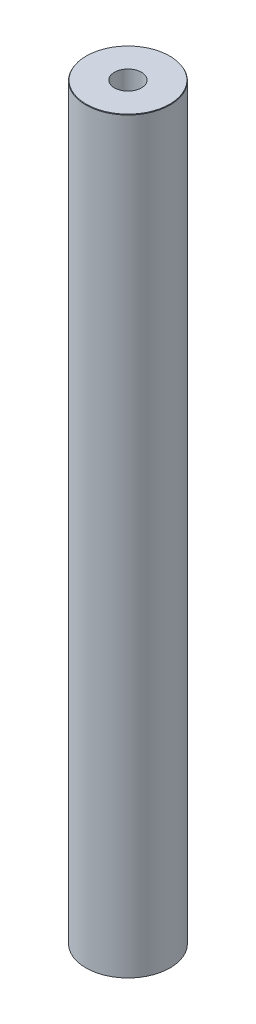
ISO-10303-21;
HEADER;
FILE_DESCRIPTION(('STEP AP214'),'2;1');
FILE_NAME('part.step','',(''),(''),'','','');
FILE_SCHEMA(('AUTOMOTIVE_DESIGN { 1 0 10303 214 1 1 1 1 }'));
ENDSEC;
DATA;
#1=APPLICATION_CONTEXT('core data for automotive mechanical design processes');
#2=APPLICATION_PROTOCOL_DEFINITION('international standard','automotive_design',2000,#1);
#3=PRODUCT_CONTEXT('',#1,'mechanical');
#4=PRODUCT('Part','Part','',(#3));
#5=PRODUCT_RELATED_PRODUCT_CATEGORY('part','',(#4));
#6=PRODUCT_DEFINITION_FORMATION('','',#4);
#7=PRODUCT_DEFINITION_CONTEXT('part definition',#1,'design');
#8=PRODUCT_DEFINITION('design','',#6,#7);
#9=PRODUCT_DEFINITION_SHAPE('','',#8);
#10=(LENGTH_UNIT() NAMED_UNIT(*) SI_UNIT(.MILLI.,.METRE.));
#11=(NAMED_UNIT(*) PLANE_ANGLE_UNIT() SI_UNIT($,.RADIAN.));
#12=(NAMED_UNIT(*) SI_UNIT($,.STERADIAN.) SOLID_ANGLE_UNIT());
#13=UNCERTAINTY_MEASURE_WITH_UNIT(LENGTH_MEASURE(1.E-05),#10,'distance_accuracy_value','');
#14=(GEOMETRIC_REPRESENTATION_CONTEXT(3) GLOBAL_UNCERTAINTY_ASSIGNED_CONTEXT((#13)) GLOBAL_UNIT_ASSIGNED_CONTEXT((#10,
#11,#12)) REPRESENTATION_CONTEXT('',''));
#15=CARTESIAN_POINT('',(0.,0.,0.));
#16=DIRECTION('',(0.,0.,1.));
#17=DIRECTION('',(1.,0.,0.));
#18=AXIS2_PLACEMENT_3D('',#15,#16,#17);
#19=CARTESIAN_POINT('',(0.,578.117468251746,0.));
#20=DIRECTION('',(0.,-1.,0.));
#21=DIRECTION('',(0.,0.,-1.));
#22=AXIS2_PLACEMENT_3D('',#19,#20,#21);
#23=CYLINDRICAL_SURFACE('',#22,32.5);
#24=CARTESIAN_POINT('',(0.,577.672115134682,0.));
#25=DIRECTION('',(0.,1.,0.));
#26=DIRECTION('',(0.,0.,1.));
#27=AXIS2_PLACEMENT_3D('',#24,#25,#26);
#28=CIRCLE('',#27,32.5);
#29=CARTESIAN_POINT('',(0.,577.672115134682,32.5));
#30=VERTEX_POINT('',#29);
#31=EDGE_CURVE('E50',#30,#30,#28,.F.);
#32=ORIENTED_EDGE('',*,*,#31,.T.);
#33=EDGE_LOOP('',(#32));
#34=FACE_BOUND('',#33,.T.);
#35=CARTESIAN_POINT('',(0.,0.257124742021442,0.));
#36=DIRECTION('',(0.,1.,0.));
#37=DIRECTION('',(0.,0.,1.));
#38=AXIS2_PLACEMENT_3D('',#35,#36,#37);
#39=CIRCLE('',#38,32.5);
#40=CARTESIAN_POINT('',(0.,0.257124742021442,32.5));
#41=VERTEX_POINT('',#40);
#42=EDGE_CURVE('E51',#41,#41,#39,.T.);
#43=ORIENTED_EDGE('',*,*,#42,.T.);
#44=EDGE_LOOP('',(#43));
#45=FACE_BOUND('',#44,.T.);
#46=ADVANCED_FACE('F39',(#34,#45),#23,.T.);
#47=CARTESIAN_POINT('',(0.,578.117468251746,0.));
#48=DIRECTION('',(0.,1.,0.));
#49=DIRECTION('',(0.,0.,1.));
#50=AXIS2_PLACEMENT_3D('',#47,#48,#49);
#51=PLANE('',#50);
#52=CARTESIAN_POINT('',(0.,578.117468251746,0.));
#53=DIRECTION('',(0.,1.,0.));
#54=DIRECTION('',(0.,0.,1.));
#55=AXIS2_PLACEMENT_3D('',#52,#53,#54);
#56=CIRCLE('',#55,32.2428752579785);
#57=CARTESIAN_POINT('',(0.,578.117468251746,32.2428752579785));
#58=VERTEX_POINT('',#57);
#59=EDGE_CURVE('E54',#58,#58,#56,.T.);
#60=ORIENTED_EDGE('',*,*,#59,.T.);
#61=EDGE_LOOP('',(#60));
#62=FACE_BOUND('',#61,.T.);
#63=CARTESIAN_POINT('',(0.,578.117468251746,0.));
#64=DIRECTION('',(0.,1.,0.));
#65=DIRECTION('',(0.,0.,1.));
#66=AXIS2_PLACEMENT_3D('',#63,#64,#65);
#67=CIRCLE('',#66,10.4689815876365);
#68=CARTESIAN_POINT('',(0.,578.117468251746,10.4689815876365));
#69=VERTEX_POINT('',#68);
#70=EDGE_CURVE('E58',#69,#69,#67,.T.);
#71=ORIENTED_EDGE('',*,*,#70,.F.);
#72=EDGE_LOOP('',(#71));
#73=FACE_BOUND('',#72,.T.);
#74=ADVANCED_FACE('F69',(#62,#73),#51,.T.);
#75=CARTESIAN_POINT('',(0.,0.,0.));
#76=DIRECTION('',(0.,1.,0.));
#77=DIRECTION('',(0.,0.,1.));
#78=AXIS2_PLACEMENT_3D('',#75,#76,#77);
#79=PLANE('',#78);
#80=CARTESIAN_POINT('',(0.,0.,0.));
#81=DIRECTION('',(0.,1.,0.));
#82=DIRECTION('',(0.,0.,1.));
#83=AXIS2_PLACEMENT_3D('',#80,#81,#82);
#84=CIRCLE('',#83,32.0546468829357);
#85=CARTESIAN_POINT('',(0.,0.,32.0546468829357));
#86=VERTEX_POINT('',#85);
#87=EDGE_CURVE('E10',#86,#86,#84,.F.);
#88=ORIENTED_EDGE('',*,*,#87,.T.);
#89=EDGE_LOOP('',(#88));
#90=FACE_BOUND('',#89,.T.);
#91=CARTESIAN_POINT('',(0.,0.,0.));
#92=DIRECTION('',(0.,1.,0.));
#93=DIRECTION('',(0.,0.,1.));
#94=AXIS2_PLACEMENT_3D('',#91,#92,#93);
#95=CIRCLE('',#94,10.4689815876365);
#96=CARTESIAN_POINT('',(0.,0.,10.4689815876365));
#97=VERTEX_POINT('',#96);
#98=EDGE_CURVE('E63',#97,#97,#95,.T.);
#99=ORIENTED_EDGE('',*,*,#98,.T.);
#100=EDGE_LOOP('',(#99));
#101=FACE_BOUND('',#100,.T.);
#102=ADVANCED_FACE('F75',(#90,#101),#79,.F.);
#103=CARTESIAN_POINT('',(0.,578.117468251746,0.));
#104=DIRECTION('',(0.,-1.,0.));
#105=DIRECTION('',(0.,0.,-1.));
#106=AXIS2_PLACEMENT_3D('',#103,#104,#105);
#107=CYLINDRICAL_SURFACE('',#106,10.4689815876365);
#108=ORIENTED_EDGE('',*,*,#70,.T.);
#109=EDGE_LOOP('',(#108));
#110=FACE_BOUND('',#109,.T.);
#111=ORIENTED_EDGE('',*,*,#98,.F.);
#112=EDGE_LOOP('',(#111));
#113=FACE_BOUND('',#112,.T.);
#114=ADVANCED_FACE('F70',(#110,#113),#107,.F.);
#115=CARTESIAN_POINT('',(0.,578.117468251746,0.));
#116=DIRECTION('',(0.,-1.,0.));
#117=DIRECTION('',(0.,0.,-1.));
#118=AXIS2_PLACEMENT_3D('',#115,#116,#117);
#119=CONICAL_SURFACE('',#118,32.2428752579785,0.523598775598242);
#120=ORIENTED_EDGE('',*,*,#31,.F.);
#121=EDGE_LOOP('',(#120));
#122=FACE_BOUND('',#121,.T.);
#123=ORIENTED_EDGE('',*,*,#59,.F.);
#124=EDGE_LOOP('',(#123));
#125=FACE_BOUND('',#124,.T.);
#126=ADVANCED_FACE('F81',(#122,#125),#119,.T.);
#127=CARTESIAN_POINT('',(0.,0.257124742021442,0.));
#128=DIRECTION('',(0.,1.,0.));
#129=DIRECTION('',(0.,0.,1.));
#130=AXIS2_PLACEMENT_3D('',#127,#128,#129);
#131=CONICAL_SURFACE('',#130,32.5,1.04719755119667);
#132=ORIENTED_EDGE('',*,*,#87,.F.);
#133=EDGE_LOOP('',(#132));
#134=FACE_BOUND('',#133,.T.);
#135=ORIENTED_EDGE('',*,*,#42,.F.);
#136=EDGE_LOOP('',(#135));
#137=FACE_BOUND('',#136,.T.);
#138=ADVANCED_FACE('F45',(#134,#137),#131,.T.);
#139=CLOSED_SHELL('',(#46,#74,#102,#114,#126,#138));
#140=MANIFOLD_SOLID_BREP('B2',#139);
#141=ADVANCED_BREP_SHAPE_REPRESENTATION('',(#18,#140),#14);
#142=SHAPE_DEFINITION_REPRESENTATION(#9,#141);
ENDSEC;
END-ISO-10303-21;
